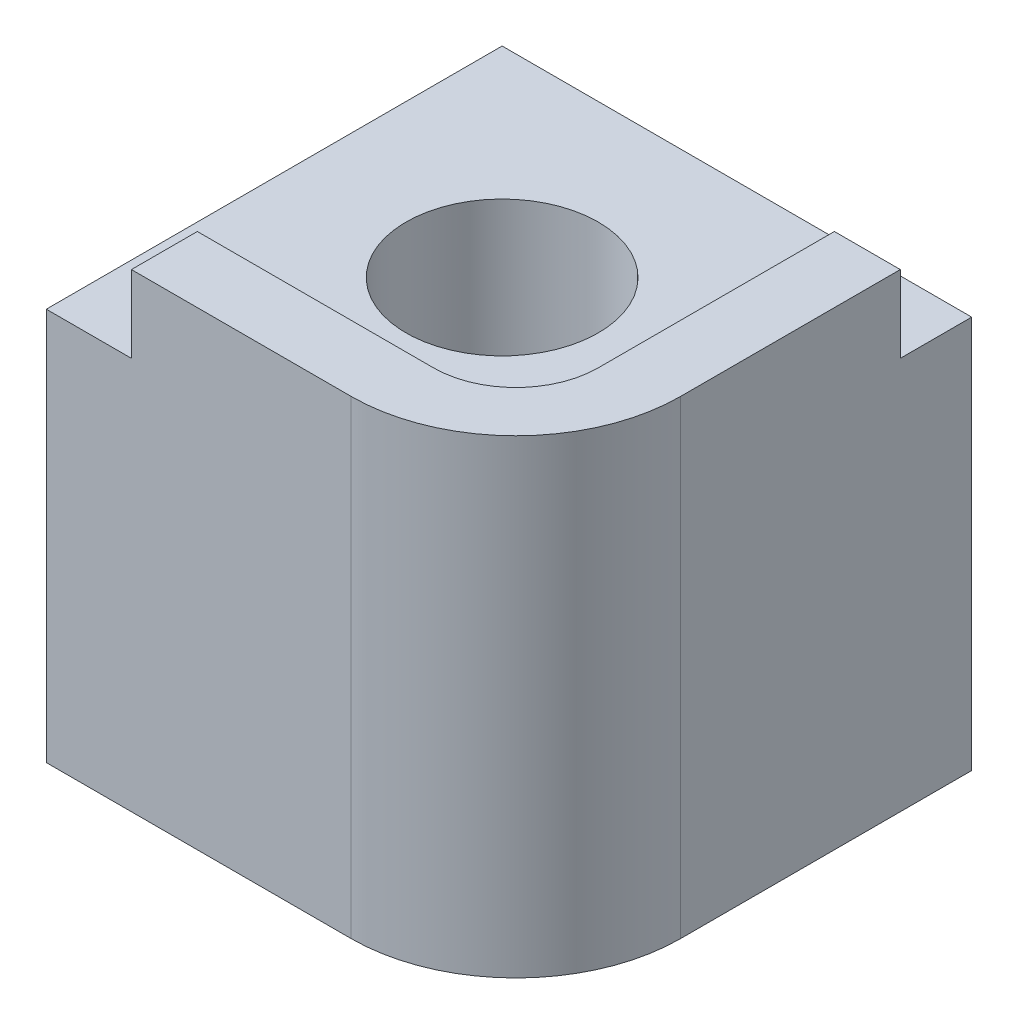
ISO-10303-21;
HEADER;
FILE_DESCRIPTION(('STEP AP214'),'2;1');
FILE_NAME('part.step','',(''),(''),'','','');
FILE_SCHEMA(('AUTOMOTIVE_DESIGN { 1 0 10303 214 1 1 1 1 }'));
ENDSEC;
DATA;
#1=APPLICATION_CONTEXT('core data for automotive mechanical design processes');
#2=APPLICATION_PROTOCOL_DEFINITION('international standard','automotive_design',2000,#1);
#3=PRODUCT_CONTEXT('',#1,'mechanical');
#4=PRODUCT('Part','Part','',(#3));
#5=PRODUCT_RELATED_PRODUCT_CATEGORY('part','',(#4));
#6=PRODUCT_DEFINITION_FORMATION('','',#4);
#7=PRODUCT_DEFINITION_CONTEXT('part definition',#1,'design');
#8=PRODUCT_DEFINITION('design','',#6,#7);
#9=PRODUCT_DEFINITION_SHAPE('','',#8);
#10=(LENGTH_UNIT() NAMED_UNIT(*) SI_UNIT(.MILLI.,.METRE.));
#11=(NAMED_UNIT(*) PLANE_ANGLE_UNIT() SI_UNIT($,.RADIAN.));
#12=(NAMED_UNIT(*) SI_UNIT($,.STERADIAN.) SOLID_ANGLE_UNIT());
#13=UNCERTAINTY_MEASURE_WITH_UNIT(LENGTH_MEASURE(1.E-05),#10,'distance_accuracy_value','');
#14=(GEOMETRIC_REPRESENTATION_CONTEXT(3) GLOBAL_UNCERTAINTY_ASSIGNED_CONTEXT((#13)) GLOBAL_UNIT_ASSIGNED_CONTEXT((#10,
#11,#12)) REPRESENTATION_CONTEXT('',''));
#15=CARTESIAN_POINT('',(0.,0.,0.));
#16=DIRECTION('',(0.,0.,1.));
#17=DIRECTION('',(1.,0.,0.));
#18=AXIS2_PLACEMENT_3D('',#15,#16,#17);
#19=CARTESIAN_POINT('',(5.55,0.,5.3));
#20=DIRECTION('',(0.,-1.,0.));
#21=DIRECTION('',(0.,0.,-1.));
#22=AXIS2_PLACEMENT_3D('',#19,#20,#21);
#23=CYLINDRICAL_SURFACE('',#22,3.);
#24=DIRECTION('',(0.,-1.,0.));
#25=VECTOR('',#24,1.);
#26=CARTESIAN_POINT('',(8.55,0.,5.3));
#27=LINE('',#26,#25);
#28=CARTESIAN_POINT('',(8.55,8.55,5.3));
#29=VERTEX_POINT('',#28);
#30=CARTESIAN_POINT('',(8.55,0.,5.3));
#31=VERTEX_POINT('',#30);
#32=EDGE_CURVE('E180',#29,#31,#27,.T.);
#33=ORIENTED_EDGE('',*,*,#32,.F.);
#34=CARTESIAN_POINT('',(5.55,8.55,5.3));
#35=DIRECTION('',(0.,-1.,0.));
#36=DIRECTION('',(1.,0.,0.));
#37=AXIS2_PLACEMENT_3D('',#34,#35,#36);
#38=CIRCLE('',#37,3.);
#39=CARTESIAN_POINT('',(5.55,8.55,8.3));
#40=VERTEX_POINT('',#39);
#41=EDGE_CURVE('E54',#40,#29,#38,.F.);
#42=ORIENTED_EDGE('',*,*,#41,.F.);
#43=DIRECTION('',(0.,-1.,0.));
#44=VECTOR('',#43,1.);
#45=CARTESIAN_POINT('',(5.55,0.,8.3));
#46=LINE('',#45,#44);
#47=CARTESIAN_POINT('',(5.55,0.,8.3));
#48=VERTEX_POINT('',#47);
#49=EDGE_CURVE('E183',#48,#40,#46,.F.);
#50=ORIENTED_EDGE('',*,*,#49,.F.);
#51=CARTESIAN_POINT('',(5.55,0.,5.3));
#52=DIRECTION('',(0.,1.,0.));
#53=DIRECTION('',(0.,0.,1.));
#54=AXIS2_PLACEMENT_3D('',#51,#52,#53);
#55=CIRCLE('',#54,3.);
#56=EDGE_CURVE('E47',#31,#48,#55,.F.);
#57=ORIENTED_EDGE('',*,*,#56,.F.);
#58=EDGE_LOOP('',(#33,#42,#50,#57));
#59=FACE_BOUND('',#58,.T.);
#60=ADVANCED_FACE('F32',(#59),#23,.T.);
#61=CARTESIAN_POINT('',(0.,0.,8.3));
#62=DIRECTION('',(1.,0.,0.));
#63=DIRECTION('',(0.,0.,-1.));
#64=AXIS2_PLACEMENT_3D('',#61,#62,#63);
#65=PLANE('',#64);
#66=DIRECTION('',(0.,-1.,0.));
#67=VECTOR('',#66,1.);
#68=CARTESIAN_POINT('',(0.,0.,8.3));
#69=LINE('',#68,#67);
#70=CARTESIAN_POINT('',(0.,7.15,8.3));
#71=VERTEX_POINT('',#70);
#72=CARTESIAN_POINT('',(0.,0.,8.3));
#73=VERTEX_POINT('',#72);
#74=EDGE_CURVE('E151',#71,#73,#69,.T.);
#75=ORIENTED_EDGE('',*,*,#74,.F.);
#76=DIRECTION('',(0.,0.,1.));
#77=VECTOR('',#76,1.);
#78=CARTESIAN_POINT('',(0.,7.15,0.));
#79=LINE('',#78,#77);
#80=CARTESIAN_POINT('',(0.,7.15,0.));
#81=VERTEX_POINT('',#80);
#82=EDGE_CURVE('E143',#81,#71,#79,.T.);
#83=ORIENTED_EDGE('',*,*,#82,.F.);
#84=DIRECTION('',(0.,-1.,0.));
#85=VECTOR('',#84,1.);
#86=CARTESIAN_POINT('',(0.,0.,0.));
#87=LINE('',#86,#85);
#88=CARTESIAN_POINT('',(0.,0.,0.));
#89=VERTEX_POINT('',#88);
#90=EDGE_CURVE('E145',#81,#89,#87,.T.);
#91=ORIENTED_EDGE('',*,*,#90,.T.);
#92=DIRECTION('',(0.,0.,-1.));
#93=VECTOR('',#92,1.);
#94=CARTESIAN_POINT('',(0.,0.,8.3));
#95=LINE('',#94,#93);
#96=EDGE_CURVE('E169',#73,#89,#95,.T.);
#97=ORIENTED_EDGE('',*,*,#96,.F.);
#98=EDGE_LOOP('',(#75,#83,#91,#97));
#99=FACE_BOUND('',#98,.T.);
#100=ADVANCED_FACE('F205',(#99),#65,.F.);
#101=CARTESIAN_POINT('',(0.,0.,8.3));
#102=DIRECTION('',(0.,1.,0.));
#103=DIRECTION('',(0.,0.,1.));
#104=AXIS2_PLACEMENT_3D('',#101,#102,#103);
#105=PLANE('',#104);
#106=CARTESIAN_POINT('',(3.65,0.,3.65));
#107=DIRECTION('',(0.,1.,0.));
#108=DIRECTION('',(0.,0.,1.));
#109=AXIS2_PLACEMENT_3D('',#106,#107,#108);
#110=CIRCLE('',#109,2.25);
#111=CARTESIAN_POINT('',(3.65,0.,5.9));
#112=VERTEX_POINT('',#111);
#113=EDGE_CURVE('E11',#112,#112,#110,.T.);
#114=ORIENTED_EDGE('',*,*,#113,.T.);
#115=EDGE_LOOP('',(#114));
#116=FACE_BOUND('',#115,.T.);
#117=DIRECTION('',(0.,0.,-1.));
#118=VECTOR('',#117,1.);
#119=CARTESIAN_POINT('',(8.55,0.,8.3));
#120=LINE('',#119,#118);
#121=CARTESIAN_POINT('',(8.55,0.,0.));
#122=VERTEX_POINT('',#121);
#123=EDGE_CURVE('E167',#31,#122,#120,.T.);
#124=ORIENTED_EDGE('',*,*,#123,.F.);
#125=ORIENTED_EDGE('',*,*,#56,.T.);
#126=DIRECTION('',(1.,0.,0.));
#127=VECTOR('',#126,1.);
#128=CARTESIAN_POINT('',(0.,0.,8.3));
#129=LINE('',#128,#127);
#130=EDGE_CURVE('E153',#73,#48,#129,.T.);
#131=ORIENTED_EDGE('',*,*,#130,.F.);
#132=ORIENTED_EDGE('',*,*,#96,.T.);
#133=DIRECTION('',(1.,0.,0.));
#134=VECTOR('',#133,1.);
#135=CARTESIAN_POINT('',(0.,0.,0.));
#136=LINE('',#135,#134);
#137=EDGE_CURVE('E161',#89,#122,#136,.T.);
#138=ORIENTED_EDGE('',*,*,#137,.T.);
#139=EDGE_LOOP('',(#124,#125,#131,#132,#138));
#140=FACE_BOUND('',#139,.T.);
#141=ADVANCED_FACE('F209',(#116,#140),#105,.F.);
#142=CARTESIAN_POINT('',(8.55,0.,8.3));
#143=DIRECTION('',(-1.,0.,0.));
#144=DIRECTION('',(0.,0.,1.));
#145=AXIS2_PLACEMENT_3D('',#142,#143,#144);
#146=PLANE('',#145);
#147=DIRECTION('',(0.,0.,-1.));
#148=VECTOR('',#147,1.);
#149=CARTESIAN_POINT('',(8.55,8.55,8.3));
#150=LINE('',#149,#148);
#151=CARTESIAN_POINT('',(8.55,8.55,1.3));
#152=VERTEX_POINT('',#151);
#153=EDGE_CURVE('E159',#29,#152,#150,.T.);
#154=ORIENTED_EDGE('',*,*,#153,.F.);
#155=ORIENTED_EDGE('',*,*,#32,.T.);
#156=ORIENTED_EDGE('',*,*,#123,.T.);
#157=DIRECTION('',(0.,1.,0.));
#158=VECTOR('',#157,1.);
#159=CARTESIAN_POINT('',(8.55,0.,0.));
#160=LINE('',#159,#158);
#161=CARTESIAN_POINT('',(8.55,7.15,0.));
#162=VERTEX_POINT('',#161);
#163=EDGE_CURVE('E154',#122,#162,#160,.T.);
#164=ORIENTED_EDGE('',*,*,#163,.T.);
#165=DIRECTION('',(0.,0.,-1.));
#166=VECTOR('',#165,1.);
#167=CARTESIAN_POINT('',(8.55,7.15,0.));
#168=LINE('',#167,#166);
#169=CARTESIAN_POINT('',(8.55,7.15,1.3));
#170=VERTEX_POINT('',#169);
#171=EDGE_CURVE('E267',#170,#162,#168,.T.);
#172=ORIENTED_EDGE('',*,*,#171,.F.);
#173=DIRECTION('',(0.,-1.,0.));
#174=VECTOR('',#173,1.);
#175=CARTESIAN_POINT('',(8.55,8.55,1.3));
#176=LINE('',#175,#174);
#177=EDGE_CURVE('E263',#152,#170,#176,.T.);
#178=ORIENTED_EDGE('',*,*,#177,.F.);
#179=EDGE_LOOP('',(#154,#155,#156,#164,#172,#178));
#180=FACE_BOUND('',#179,.T.);
#181=ADVANCED_FACE('F218',(#180),#146,.F.);
#182=CARTESIAN_POINT('',(0.,8.55,8.3));
#183=DIRECTION('',(0.,-1.,0.));
#184=DIRECTION('',(1.,0.,0.));
#185=AXIS2_PLACEMENT_3D('',#182,#183,#184);
#186=PLANE('',#185);
#187=DIRECTION('',(-1.,0.,0.));
#188=VECTOR('',#187,1.);
#189=CARTESIAN_POINT('',(0.,8.55,8.3));
#190=LINE('',#189,#188);
#191=CARTESIAN_POINT('',(1.55,8.55,8.3));
#192=VERTEX_POINT('',#191);
#193=EDGE_CURVE('E157',#40,#192,#190,.T.);
#194=ORIENTED_EDGE('',*,*,#193,.F.);
#195=ORIENTED_EDGE('',*,*,#41,.T.);
#196=ORIENTED_EDGE('',*,*,#153,.T.);
#197=DIRECTION('',(1.,0.,0.));
#198=VECTOR('',#197,1.);
#199=CARTESIAN_POINT('',(0.,8.55,1.3));
#200=LINE('',#199,#198);
#201=CARTESIAN_POINT('',(7.35,8.55,1.3));
#202=VERTEX_POINT('',#201);
#203=EDGE_CURVE('E270',#202,#152,#200,.T.);
#204=ORIENTED_EDGE('',*,*,#203,.F.);
#205=DIRECTION('',(0.,0.,-1.));
#206=VECTOR('',#205,1.);
#207=CARTESIAN_POINT('',(7.35,8.55,1.3));
#208=LINE('',#207,#206);
#209=CARTESIAN_POINT('',(7.35,8.55,5.6));
#210=VERTEX_POINT('',#209);
#211=EDGE_CURVE('E127',#210,#202,#208,.T.);
#212=ORIENTED_EDGE('',*,*,#211,.F.);
#213=CARTESIAN_POINT('',(5.85,8.55,5.6));
#214=DIRECTION('',(0.,-1.,0.));
#215=DIRECTION('',(1.,0.,0.));
#216=AXIS2_PLACEMENT_3D('',#213,#214,#215);
#217=CIRCLE('',#216,1.5);
#218=CARTESIAN_POINT('',(5.85,8.55,7.1));
#219=VERTEX_POINT('',#218);
#220=EDGE_CURVE('E178',#210,#219,#217,.T.);
#221=ORIENTED_EDGE('',*,*,#220,.T.);
#222=DIRECTION('',(1.,0.,0.));
#223=VECTOR('',#222,1.);
#224=CARTESIAN_POINT('',(1.55,8.55,7.1));
#225=LINE('',#224,#223);
#226=CARTESIAN_POINT('',(1.55,8.55,7.1));
#227=VERTEX_POINT('',#226);
#228=EDGE_CURVE('E189',#227,#219,#225,.T.);
#229=ORIENTED_EDGE('',*,*,#228,.F.);
#230=DIRECTION('',(0.,0.,1.));
#231=VECTOR('',#230,1.);
#232=CARTESIAN_POINT('',(1.55,8.55,0.));
#233=LINE('',#232,#231);
#234=EDGE_CURVE('E136',#227,#192,#233,.T.);
#235=ORIENTED_EDGE('',*,*,#234,.T.);
#236=EDGE_LOOP('',(#194,#195,#196,#204,#212,#221,#229,#235));
#237=FACE_BOUND('',#236,.T.);
#238=ADVANCED_FACE('F222',(#237),#186,.F.);
#239=CARTESIAN_POINT('',(0.,0.,8.3));
#240=DIRECTION('',(0.,0.,-1.));
#241=DIRECTION('',(-1.,0.,0.));
#242=AXIS2_PLACEMENT_3D('',#239,#240,#241);
#243=PLANE('',#242);
#244=ORIENTED_EDGE('',*,*,#130,.T.);
#245=ORIENTED_EDGE('',*,*,#49,.T.);
#246=ORIENTED_EDGE('',*,*,#193,.T.);
#247=DIRECTION('',(0.,1.,0.));
#248=VECTOR('',#247,1.);
#249=CARTESIAN_POINT('',(1.55,8.55,8.3));
#250=LINE('',#249,#248);
#251=CARTESIAN_POINT('',(1.55,7.15,8.3));
#252=VERTEX_POINT('',#251);
#253=EDGE_CURVE('E276',#252,#192,#250,.T.);
#254=ORIENTED_EDGE('',*,*,#253,.F.);
#255=DIRECTION('',(1.,0.,0.));
#256=VECTOR('',#255,1.);
#257=CARTESIAN_POINT('',(0.,7.15,8.3));
#258=LINE('',#257,#256);
#259=EDGE_CURVE('E141',#71,#252,#258,.T.);
#260=ORIENTED_EDGE('',*,*,#259,.F.);
#261=ORIENTED_EDGE('',*,*,#74,.T.);
#262=EDGE_LOOP('',(#244,#245,#246,#254,#260,#261));
#263=FACE_BOUND('',#262,.T.);
#264=ADVANCED_FACE('F226',(#263),#243,.F.);
#265=CARTESIAN_POINT('',(0.,0.,0.));
#266=DIRECTION('',(0.,0.,-1.));
#267=DIRECTION('',(-1.,0.,0.));
#268=AXIS2_PLACEMENT_3D('',#265,#266,#267);
#269=PLANE('',#268);
#270=DIRECTION('',(1.,0.,0.));
#271=VECTOR('',#270,1.);
#272=CARTESIAN_POINT('',(0.,7.15,0.));
#273=LINE('',#272,#271);
#274=EDGE_CURVE('E147',#81,#162,#273,.T.);
#275=ORIENTED_EDGE('',*,*,#274,.T.);
#276=ORIENTED_EDGE('',*,*,#163,.F.);
#277=ORIENTED_EDGE('',*,*,#137,.F.);
#278=ORIENTED_EDGE('',*,*,#90,.F.);
#279=EDGE_LOOP('',(#275,#276,#277,#278));
#280=FACE_BOUND('',#279,.T.);
#281=ADVANCED_FACE('F228',(#280),#269,.T.);
#282=CARTESIAN_POINT('',(1.55,8.55,0.));
#283=DIRECTION('',(1.,0.,0.));
#284=DIRECTION('',(0.,1.,0.));
#285=AXIS2_PLACEMENT_3D('',#282,#283,#284);
#286=PLANE('',#285);
#287=ORIENTED_EDGE('',*,*,#234,.F.);
#288=DIRECTION('',(0.,1.,0.));
#289=VECTOR('',#288,1.);
#290=CARTESIAN_POINT('',(1.55,7.15,7.1));
#291=LINE('',#290,#289);
#292=CARTESIAN_POINT('',(1.55,7.15,7.1));
#293=VERTEX_POINT('',#292);
#294=EDGE_CURVE('E119',#293,#227,#291,.T.);
#295=ORIENTED_EDGE('',*,*,#294,.F.);
#296=DIRECTION('',(0.,0.,1.));
#297=VECTOR('',#296,1.);
#298=CARTESIAN_POINT('',(1.55,7.15,0.));
#299=LINE('',#298,#297);
#300=EDGE_CURVE('E133',#293,#252,#299,.T.);
#301=ORIENTED_EDGE('',*,*,#300,.T.);
#302=ORIENTED_EDGE('',*,*,#253,.T.);
#303=EDGE_LOOP('',(#287,#295,#301,#302));
#304=FACE_BOUND('',#303,.T.);
#305=ADVANCED_FACE('F131',(#304),#286,.F.);
#306=CARTESIAN_POINT('',(0.,7.15,0.));
#307=DIRECTION('',(0.,-1.,0.));
#308=DIRECTION('',(0.,0.,-1.));
#309=AXIS2_PLACEMENT_3D('',#306,#307,#308);
#310=PLANE('',#309);
#311=CARTESIAN_POINT('',(3.65,7.15,3.65));
#312=DIRECTION('',(0.,-1.,0.));
#313=DIRECTION('',(0.,0.,-1.));
#314=AXIS2_PLACEMENT_3D('',#311,#312,#313);
#315=CIRCLE('',#314,1.75);
#316=CARTESIAN_POINT('',(3.65,7.15,1.9));
#317=VERTEX_POINT('',#316);
#318=EDGE_CURVE('E187',#317,#317,#315,.T.);
#319=ORIENTED_EDGE('',*,*,#318,.T.);
#320=EDGE_LOOP('',(#319));
#321=FACE_BOUND('',#320,.T.);
#322=DIRECTION('',(1.,0.,0.));
#323=VECTOR('',#322,1.);
#324=CARTESIAN_POINT('',(1.55,7.15,7.1));
#325=LINE('',#324,#323);
#326=CARTESIAN_POINT('',(5.85,7.15,7.1));
#327=VERTEX_POINT('',#326);
#328=EDGE_CURVE('E115',#293,#327,#325,.T.);
#329=ORIENTED_EDGE('',*,*,#328,.T.);
#330=CARTESIAN_POINT('',(5.85,7.15,5.6));
#331=DIRECTION('',(0.,-1.,0.));
#332=DIRECTION('',(0.,0.,-1.));
#333=AXIS2_PLACEMENT_3D('',#330,#331,#332);
#334=CIRCLE('',#333,1.5);
#335=CARTESIAN_POINT('',(7.35,7.15,5.6));
#336=VERTEX_POINT('',#335);
#337=EDGE_CURVE('E176',#327,#336,#334,.F.);
#338=ORIENTED_EDGE('',*,*,#337,.T.);
#339=DIRECTION('',(0.,0.,-1.));
#340=VECTOR('',#339,1.);
#341=CARTESIAN_POINT('',(7.35,7.15,1.3));
#342=LINE('',#341,#340);
#343=CARTESIAN_POINT('',(7.35,7.15,1.3));
#344=VERTEX_POINT('',#343);
#345=EDGE_CURVE('E126',#336,#344,#342,.T.);
#346=ORIENTED_EDGE('',*,*,#345,.T.);
#347=DIRECTION('',(1.,0.,0.));
#348=VECTOR('',#347,1.);
#349=CARTESIAN_POINT('',(0.,7.15,1.3));
#350=LINE('',#349,#348);
#351=EDGE_CURVE('E271',#344,#170,#350,.T.);
#352=ORIENTED_EDGE('',*,*,#351,.T.);
#353=ORIENTED_EDGE('',*,*,#171,.T.);
#354=ORIENTED_EDGE('',*,*,#274,.F.);
#355=ORIENTED_EDGE('',*,*,#82,.T.);
#356=ORIENTED_EDGE('',*,*,#259,.T.);
#357=ORIENTED_EDGE('',*,*,#300,.F.);
#358=EDGE_LOOP('',(#329,#338,#346,#352,#353,#354,#355,#356,#357));
#359=FACE_BOUND('',#358,.T.);
#360=ADVANCED_FACE('F139',(#321,#359),#310,.F.);
#361=CARTESIAN_POINT('',(0.,8.55,1.3));
#362=DIRECTION('',(0.,0.,1.));
#363=DIRECTION('',(0.,-1.,0.));
#364=AXIS2_PLACEMENT_3D('',#361,#362,#363);
#365=PLANE('',#364);
#366=ORIENTED_EDGE('',*,*,#351,.F.);
#367=DIRECTION('',(0.,1.,0.));
#368=VECTOR('',#367,1.);
#369=CARTESIAN_POINT('',(7.35,7.15,1.3));
#370=LINE('',#369,#368);
#371=EDGE_CURVE('E137',#344,#202,#370,.T.);
#372=ORIENTED_EDGE('',*,*,#371,.T.);
#373=ORIENTED_EDGE('',*,*,#203,.T.);
#374=ORIENTED_EDGE('',*,*,#177,.T.);
#375=EDGE_LOOP('',(#366,#372,#373,#374));
#376=FACE_BOUND('',#375,.T.);
#377=ADVANCED_FACE('F237',(#376),#365,.F.);
#378=CARTESIAN_POINT('',(7.35,7.15,1.3));
#379=DIRECTION('',(1.,0.,0.));
#380=DIRECTION('',(0.,1.,0.));
#381=AXIS2_PLACEMENT_3D('',#378,#379,#380);
#382=PLANE('',#381);
#383=ORIENTED_EDGE('',*,*,#345,.F.);
#384=DIRECTION('',(0.,1.,0.));
#385=VECTOR('',#384,1.);
#386=CARTESIAN_POINT('',(7.35,8.55,5.6));
#387=LINE('',#386,#385);
#388=EDGE_CURVE('E172',#336,#210,#387,.T.);
#389=ORIENTED_EDGE('',*,*,#388,.T.);
#390=ORIENTED_EDGE('',*,*,#211,.T.);
#391=ORIENTED_EDGE('',*,*,#371,.F.);
#392=EDGE_LOOP('',(#383,#389,#390,#391));
#393=FACE_BOUND('',#392,.T.);
#394=ADVANCED_FACE('F243',(#393),#382,.F.);
#395=CARTESIAN_POINT('',(1.55,7.15,7.1));
#396=DIRECTION('',(0.,0.,1.));
#397=DIRECTION('',(1.,0.,0.));
#398=AXIS2_PLACEMENT_3D('',#395,#396,#397);
#399=PLANE('',#398);
#400=ORIENTED_EDGE('',*,*,#228,.T.);
#401=DIRECTION('',(0.,1.,0.));
#402=VECTOR('',#401,1.);
#403=CARTESIAN_POINT('',(5.85,7.15,7.1));
#404=LINE('',#403,#402);
#405=EDGE_CURVE('E122',#219,#327,#404,.F.);
#406=ORIENTED_EDGE('',*,*,#405,.T.);
#407=ORIENTED_EDGE('',*,*,#328,.F.);
#408=ORIENTED_EDGE('',*,*,#294,.T.);
#409=EDGE_LOOP('',(#400,#406,#407,#408));
#410=FACE_BOUND('',#409,.T.);
#411=ADVANCED_FACE('F118',(#410),#399,.F.);
#412=CARTESIAN_POINT('',(5.85,7.15,5.6));
#413=DIRECTION('',(0.,-1.,0.));
#414=DIRECTION('',(1.,0.,0.));
#415=AXIS2_PLACEMENT_3D('',#412,#413,#414);
#416=CYLINDRICAL_SURFACE('',#415,1.5);
#417=ORIENTED_EDGE('',*,*,#337,.F.);
#418=ORIENTED_EDGE('',*,*,#405,.F.);
#419=ORIENTED_EDGE('',*,*,#220,.F.);
#420=ORIENTED_EDGE('',*,*,#388,.F.);
#421=EDGE_LOOP('',(#417,#418,#419,#420));
#422=FACE_BOUND('',#421,.T.);
#423=ADVANCED_FACE('F201',(#422),#416,.F.);
#424=CARTESIAN_POINT('',(3.65,8.55,3.65));
#425=DIRECTION('',(0.,-1.,0.));
#426=DIRECTION('',(0.,0.,-1.));
#427=AXIS2_PLACEMENT_3D('',#424,#425,#426);
#428=CYLINDRICAL_SURFACE('',#427,1.75);
#429=CARTESIAN_POINT('',(3.65,0.350103769104855,3.65));
#430=DIRECTION('',(0.,1.,0.));
#431=DIRECTION('',(0.,0.,1.));
#432=AXIS2_PLACEMENT_3D('',#429,#430,#431);
#433=CIRCLE('',#432,1.75);
#434=CARTESIAN_POINT('',(3.65,0.350103769104855,5.4));
#435=VERTEX_POINT('',#434);
#436=EDGE_CURVE('E40',#435,#435,#433,.F.);
#437=ORIENTED_EDGE('',*,*,#436,.T.);
#438=EDGE_LOOP('',(#437));
#439=FACE_BOUND('',#438,.T.);
#440=ORIENTED_EDGE('',*,*,#318,.F.);
#441=EDGE_LOOP('',(#440));
#442=FACE_BOUND('',#441,.T.);
#443=ADVANCED_FACE('F193',(#439,#442),#428,.F.);
#444=CARTESIAN_POINT('',(3.65,0.350103769104855,3.65));
#445=DIRECTION('',(0.,-1.,0.));
#446=DIRECTION('',(0.,0.,-1.));
#447=AXIS2_PLACEMENT_3D('',#444,#445,#446);
#448=CONICAL_SURFACE('',#447,1.75,0.959931088596884);
#449=ORIENTED_EDGE('',*,*,#113,.F.);
#450=EDGE_LOOP('',(#449));
#451=FACE_BOUND('',#450,.T.);
#452=ORIENTED_EDGE('',*,*,#436,.F.);
#453=EDGE_LOOP('',(#452));
#454=FACE_BOUND('',#453,.T.);
#455=ADVANCED_FACE('F34',(#451,#454),#448,.F.);
#456=CLOSED_SHELL('',(#60,#100,#141,#181,#238,#264,#281,#305,#360,#377,#394,#411,#423,#443,#455));
#457=MANIFOLD_SOLID_BREP('B2',#456);
#458=ADVANCED_BREP_SHAPE_REPRESENTATION('',(#18,#457),#14);
#459=SHAPE_DEFINITION_REPRESENTATION(#9,#458);
ENDSEC;
END-ISO-10303-21;
